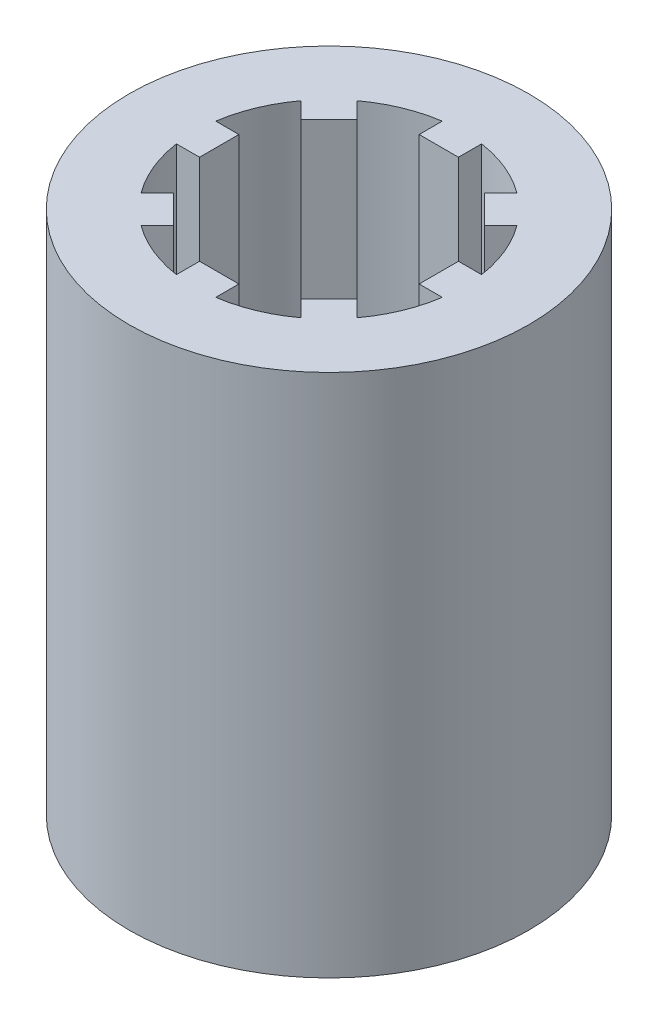
ISO-10303-21;
HEADER;
FILE_DESCRIPTION(('STEP AP214'),'2;1');
FILE_NAME('part.step','',(''),(''),'','','');
FILE_SCHEMA(('AUTOMOTIVE_DESIGN { 1 0 10303 214 1 1 1 1 }'));
ENDSEC;
DATA;
#1=APPLICATION_CONTEXT('core data for automotive mechanical design processes');
#2=APPLICATION_PROTOCOL_DEFINITION('international standard','automotive_design',2000,#1);
#3=PRODUCT_CONTEXT('',#1,'mechanical');
#4=PRODUCT('Part','Part','',(#3));
#5=PRODUCT_RELATED_PRODUCT_CATEGORY('part','',(#4));
#6=PRODUCT_DEFINITION_FORMATION('','',#4);
#7=PRODUCT_DEFINITION_CONTEXT('part definition',#1,'design');
#8=PRODUCT_DEFINITION('design','',#6,#7);
#9=PRODUCT_DEFINITION_SHAPE('','',#8);
#10=(LENGTH_UNIT() NAMED_UNIT(*) SI_UNIT(.MILLI.,.METRE.));
#11=(NAMED_UNIT(*) PLANE_ANGLE_UNIT() SI_UNIT($,.RADIAN.));
#12=(NAMED_UNIT(*) SI_UNIT($,.STERADIAN.) SOLID_ANGLE_UNIT());
#13=UNCERTAINTY_MEASURE_WITH_UNIT(LENGTH_MEASURE(1.E-05),#10,'distance_accuracy_value','');
#14=(GEOMETRIC_REPRESENTATION_CONTEXT(3) GLOBAL_UNCERTAINTY_ASSIGNED_CONTEXT((#13)) GLOBAL_UNIT_ASSIGNED_CONTEXT((#10,
#11,#12)) REPRESENTATION_CONTEXT('',''));
#15=CARTESIAN_POINT('',(0.,0.,0.));
#16=DIRECTION('',(0.,0.,1.));
#17=DIRECTION('',(1.,0.,0.));
#18=AXIS2_PLACEMENT_3D('',#15,#16,#17);
#19=CARTESIAN_POINT('',(0.,50.8,0.));
#20=DIRECTION('',(0.,1.,0.));
#21=DIRECTION('',(0.,0.,1.));
#22=AXIS2_PLACEMENT_3D('',#19,#20,#21);
#23=PLANE('',#22);
#24=CARTESIAN_POINT('',(0.,50.8,0.));
#25=DIRECTION('',(0.,1.,0.));
#26=DIRECTION('',(0.,0.,1.));
#27=AXIS2_PLACEMENT_3D('',#24,#25,#26);
#28=CIRCLE('',#27,19.3675);
#29=CARTESIAN_POINT('',(0.,50.8,19.3675));
#30=VERTEX_POINT('',#29);
#31=EDGE_CURVE('E11',#30,#30,#28,.T.);
#32=ORIENTED_EDGE('',*,*,#31,.T.);
#33=EDGE_LOOP('',(#32));
#34=FACE_BOUND('',#33,.T.);
#35=DIRECTION('',(0.707106781186544,0.,0.707106781186552));
#36=VECTOR('',#35,1.);
#37=CARTESIAN_POINT('',(-7.75862688564912,50.8,-10.4527037219699));
#38=LINE('',#37,#36);
#39=CARTESIAN_POINT('',(-7.75862688564912,50.8,-10.4527037219699));
#40=VERTEX_POINT('',#39);
#41=CARTESIAN_POINT('',(-6.17392608323505,50.8,-8.86800291955578));
#42=VERTEX_POINT('',#41);
#43=EDGE_CURVE('E258',#40,#42,#38,.T.);
#44=ORIENTED_EDGE('',*,*,#43,.F.);
#45=CARTESIAN_POINT('',(0.,50.8,0.));
#46=DIRECTION('',(0.,1.,0.));
#47=DIRECTION('',(0.,0.,1.));
#48=AXIS2_PLACEMENT_3D('',#45,#46,#47);
#49=CIRCLE('',#48,13.0175);
#50=CARTESIAN_POINT('',(-1.905,50.8,-12.8773553670775));
#51=VERTEX_POINT('',#50);
#52=EDGE_CURVE('E249',#51,#40,#49,.T.);
#53=ORIENTED_EDGE('',*,*,#52,.F.);
#54=DIRECTION('',(0.,0.,-1.));
#55=VECTOR('',#54,1.);
#56=CARTESIAN_POINT('',(-1.905,50.8,-12.8773553670775));
#57=LINE('',#56,#55);
#58=CARTESIAN_POINT('',(-1.905,50.8,-10.63625));
#59=VERTEX_POINT('',#58);
#60=EDGE_CURVE('E361',#59,#51,#57,.T.);
#61=ORIENTED_EDGE('',*,*,#60,.F.);
#62=DIRECTION('',(-1.,0.,0.));
#63=VECTOR('',#62,1.);
#64=CARTESIAN_POINT('',(1.90500000000001,50.8,-10.63625));
#65=LINE('',#64,#63);
#66=CARTESIAN_POINT('',(1.90500000000001,50.8,-10.63625));
#67=VERTEX_POINT('',#66);
#68=EDGE_CURVE('E358',#67,#59,#65,.T.);
#69=ORIENTED_EDGE('',*,*,#68,.F.);
#70=DIRECTION('',(0.,0.,1.));
#71=VECTOR('',#70,1.);
#72=CARTESIAN_POINT('',(1.905,50.8,-12.8773553670775));
#73=LINE('',#72,#71);
#74=CARTESIAN_POINT('',(1.905,50.8,-12.8773553670775));
#75=VERTEX_POINT('',#74);
#76=EDGE_CURVE('E355',#75,#67,#73,.T.);
#77=ORIENTED_EDGE('',*,*,#76,.F.);
#78=CARTESIAN_POINT('',(0.,50.8,0.));
#79=DIRECTION('',(0.,1.,0.));
#80=DIRECTION('',(0.,0.,1.));
#81=AXIS2_PLACEMENT_3D('',#78,#79,#80);
#82=CIRCLE('',#81,13.0175);
#83=CARTESIAN_POINT('',(7.75862688564911,50.8,-10.4527037219699));
#84=VERTEX_POINT('',#83);
#85=EDGE_CURVE('E352',#84,#75,#82,.T.);
#86=ORIENTED_EDGE('',*,*,#85,.F.);
#87=DIRECTION('',(0.707106781186548,0.,-0.707106781186547));
#88=VECTOR('',#87,1.);
#89=CARTESIAN_POINT('',(7.75862688564911,50.8,-10.4527037219699));
#90=LINE('',#89,#88);
#91=CARTESIAN_POINT('',(6.17392608323504,50.8,-8.86800291955579));
#92=VERTEX_POINT('',#91);
#93=EDGE_CURVE('E349',#92,#84,#90,.T.);
#94=ORIENTED_EDGE('',*,*,#93,.F.);
#95=DIRECTION('',(-0.707106781186547,0.,-0.707106781186548));
#96=VECTOR('',#95,1.);
#97=CARTESIAN_POINT('',(8.86800291955579,50.8,-6.17392608323503));
#98=LINE('',#97,#96);
#99=CARTESIAN_POINT('',(8.86800291955579,50.8,-6.17392608323503));
#100=VERTEX_POINT('',#99);
#101=EDGE_CURVE('E346',#100,#92,#98,.T.);
#102=ORIENTED_EDGE('',*,*,#101,.F.);
#103=DIRECTION('',(-0.707106781186543,0.,0.707106781186552));
#104=VECTOR('',#103,1.);
#105=CARTESIAN_POINT('',(10.4527037219699,50.8,-7.75862688564912));
#106=LINE('',#105,#104);
#107=CARTESIAN_POINT('',(10.4527037219699,50.8,-7.75862688564912));
#108=VERTEX_POINT('',#107);
#109=EDGE_CURVE('E343',#108,#100,#106,.T.);
#110=ORIENTED_EDGE('',*,*,#109,.F.);
#111=CARTESIAN_POINT('',(0.,50.8,0.));
#112=DIRECTION('',(0.,1.,0.));
#113=DIRECTION('',(0.,0.,1.));
#114=AXIS2_PLACEMENT_3D('',#111,#112,#113);
#115=CIRCLE('',#114,13.0175);
#116=CARTESIAN_POINT('',(12.8773553670775,50.8,-1.905));
#117=VERTEX_POINT('',#116);
#118=EDGE_CURVE('E340',#117,#108,#115,.T.);
#119=ORIENTED_EDGE('',*,*,#118,.F.);
#120=DIRECTION('',(1.,0.,0.));
#121=VECTOR('',#120,1.);
#122=CARTESIAN_POINT('',(12.8773553670775,50.8,-1.905));
#123=LINE('',#122,#121);
#124=CARTESIAN_POINT('',(10.63625,50.8,-1.905));
#125=VERTEX_POINT('',#124);
#126=EDGE_CURVE('E337',#125,#117,#123,.T.);
#127=ORIENTED_EDGE('',*,*,#126,.F.);
#128=DIRECTION('',(0.,0.,-1.));
#129=VECTOR('',#128,1.);
#130=CARTESIAN_POINT('',(10.63625,50.8,1.905));
#131=LINE('',#130,#129);
#132=CARTESIAN_POINT('',(10.63625,50.8,1.905));
#133=VERTEX_POINT('',#132);
#134=EDGE_CURVE('E334',#133,#125,#131,.T.);
#135=ORIENTED_EDGE('',*,*,#134,.F.);
#136=DIRECTION('',(-1.,0.,0.));
#137=VECTOR('',#136,1.);
#138=CARTESIAN_POINT('',(12.8773553670775,50.8,1.905));
#139=LINE('',#138,#137);
#140=CARTESIAN_POINT('',(12.8773553670775,50.8,1.905));
#141=VERTEX_POINT('',#140);
#142=EDGE_CURVE('E331',#141,#133,#139,.T.);
#143=ORIENTED_EDGE('',*,*,#142,.F.);
#144=CARTESIAN_POINT('',(0.,50.8,0.));
#145=DIRECTION('',(0.,1.,0.));
#146=DIRECTION('',(0.,0.,1.));
#147=AXIS2_PLACEMENT_3D('',#144,#145,#146);
#148=CIRCLE('',#147,13.0175);
#149=CARTESIAN_POINT('',(10.4527037219699,50.8,7.75862688564911));
#150=VERTEX_POINT('',#149);
#151=EDGE_CURVE('E328',#150,#141,#148,.T.);
#152=ORIENTED_EDGE('',*,*,#151,.F.);
#153=DIRECTION('',(0.707106781186548,0.,0.707106781186547));
#154=VECTOR('',#153,1.);
#155=CARTESIAN_POINT('',(10.4527037219699,50.8,7.75862688564911));
#156=LINE('',#155,#154);
#157=CARTESIAN_POINT('',(8.86800291955579,50.8,6.17392608323503));
#158=VERTEX_POINT('',#157);
#159=EDGE_CURVE('E325',#158,#150,#156,.T.);
#160=ORIENTED_EDGE('',*,*,#159,.F.);
#161=DIRECTION('',(0.707106781186547,0.,-0.707106781186548));
#162=VECTOR('',#161,1.);
#163=CARTESIAN_POINT('',(6.17392608323504,50.8,8.86800291955579));
#164=LINE('',#163,#162);
#165=CARTESIAN_POINT('',(6.17392608323504,50.8,8.86800291955579));
#166=VERTEX_POINT('',#165);
#167=EDGE_CURVE('E322',#166,#158,#164,.T.);
#168=ORIENTED_EDGE('',*,*,#167,.F.);
#169=DIRECTION('',(-0.707106781186552,0.,-0.707106781186543));
#170=VECTOR('',#169,1.);
#171=CARTESIAN_POINT('',(7.75862688564913,50.8,10.4527037219699));
#172=LINE('',#171,#170);
#173=CARTESIAN_POINT('',(7.75862688564913,50.8,10.4527037219699));
#174=VERTEX_POINT('',#173);
#175=EDGE_CURVE('E319',#174,#166,#172,.T.);
#176=ORIENTED_EDGE('',*,*,#175,.F.);
#177=CARTESIAN_POINT('',(0.,50.8,0.));
#178=DIRECTION('',(0.,1.,0.));
#179=DIRECTION('',(0.,0.,1.));
#180=AXIS2_PLACEMENT_3D('',#177,#178,#179);
#181=CIRCLE('',#180,13.0175);
#182=CARTESIAN_POINT('',(1.905,50.8,12.8773553670775));
#183=VERTEX_POINT('',#182);
#184=EDGE_CURVE('E316',#183,#174,#181,.T.);
#185=ORIENTED_EDGE('',*,*,#184,.F.);
#186=DIRECTION('',(0.,0.,1.));
#187=VECTOR('',#186,1.);
#188=CARTESIAN_POINT('',(1.905,50.8,12.8773553670775));
#189=LINE('',#188,#187);
#190=CARTESIAN_POINT('',(1.905,50.8,10.63625));
#191=VERTEX_POINT('',#190);
#192=EDGE_CURVE('E313',#191,#183,#189,.T.);
#193=ORIENTED_EDGE('',*,*,#192,.F.);
#194=DIRECTION('',(1.,0.,0.));
#195=VECTOR('',#194,1.);
#196=CARTESIAN_POINT('',(-1.905,50.8,10.63625));
#197=LINE('',#196,#195);
#198=CARTESIAN_POINT('',(-1.905,50.8,10.63625));
#199=VERTEX_POINT('',#198);
#200=EDGE_CURVE('E310',#199,#191,#197,.T.);
#201=ORIENTED_EDGE('',*,*,#200,.F.);
#202=DIRECTION('',(0.,0.,-1.));
#203=VECTOR('',#202,1.);
#204=CARTESIAN_POINT('',(-1.905,50.8,12.8773553670775));
#205=LINE('',#204,#203);
#206=CARTESIAN_POINT('',(-1.90500000000001,50.8,12.8773553670775));
#207=VERTEX_POINT('',#206);
#208=EDGE_CURVE('E307',#207,#199,#205,.T.);
#209=ORIENTED_EDGE('',*,*,#208,.F.);
#210=CARTESIAN_POINT('',(0.,50.8,0.));
#211=DIRECTION('',(0.,1.,0.));
#212=DIRECTION('',(0.,0.,1.));
#213=AXIS2_PLACEMENT_3D('',#210,#211,#212);
#214=CIRCLE('',#213,13.0175);
#215=CARTESIAN_POINT('',(-7.75862688564911,50.8,10.4527037219699));
#216=VERTEX_POINT('',#215);
#217=EDGE_CURVE('E304',#216,#207,#214,.T.);
#218=ORIENTED_EDGE('',*,*,#217,.F.);
#219=DIRECTION('',(-0.707106781186547,0.,0.707106781186548));
#220=VECTOR('',#219,1.);
#221=CARTESIAN_POINT('',(-7.75862688564911,50.8,10.4527037219699));
#222=LINE('',#221,#220);
#223=CARTESIAN_POINT('',(-6.17392608323503,50.8,8.86800291955579));
#224=VERTEX_POINT('',#223);
#225=EDGE_CURVE('E301',#224,#216,#222,.T.);
#226=ORIENTED_EDGE('',*,*,#225,.F.);
#227=DIRECTION('',(0.707106781186548,0.,0.707106781186547));
#228=VECTOR('',#227,1.);
#229=CARTESIAN_POINT('',(-8.86800291955579,50.8,6.17392608323504));
#230=LINE('',#229,#228);
#231=CARTESIAN_POINT('',(-8.86800291955579,50.8,6.17392608323504));
#232=VERTEX_POINT('',#231);
#233=EDGE_CURVE('E298',#232,#224,#230,.T.);
#234=ORIENTED_EDGE('',*,*,#233,.F.);
#235=DIRECTION('',(0.707106781186544,0.,-0.707106781186551));
#236=VECTOR('',#235,1.);
#237=CARTESIAN_POINT('',(-10.4527037219699,50.8,7.75862688564913));
#238=LINE('',#237,#236);
#239=CARTESIAN_POINT('',(-10.4527037219699,50.8,7.75862688564912));
#240=VERTEX_POINT('',#239);
#241=EDGE_CURVE('E295',#240,#232,#238,.T.);
#242=ORIENTED_EDGE('',*,*,#241,.F.);
#243=CARTESIAN_POINT('',(0.,50.8,0.));
#244=DIRECTION('',(0.,1.,0.));
#245=DIRECTION('',(0.,0.,1.));
#246=AXIS2_PLACEMENT_3D('',#243,#244,#245);
#247=CIRCLE('',#246,13.0175);
#248=CARTESIAN_POINT('',(-12.8773553670775,50.8,1.90500000000003));
#249=VERTEX_POINT('',#248);
#250=EDGE_CURVE('E292',#249,#240,#247,.T.);
#251=ORIENTED_EDGE('',*,*,#250,.F.);
#252=DIRECTION('',(-1.,0.,0.));
#253=VECTOR('',#252,1.);
#254=CARTESIAN_POINT('',(-12.8773553670775,50.8,1.90500000000003));
#255=LINE('',#254,#253);
#256=CARTESIAN_POINT('',(-10.63625,50.8,1.90500000000002));
#257=VERTEX_POINT('',#256);
#258=EDGE_CURVE('E289',#257,#249,#255,.T.);
#259=ORIENTED_EDGE('',*,*,#258,.F.);
#260=DIRECTION('',(0.,0.,1.));
#261=VECTOR('',#260,1.);
#262=CARTESIAN_POINT('',(-10.63625,50.8,-1.90499999999999));
#263=LINE('',#262,#261);
#264=CARTESIAN_POINT('',(-10.63625,50.8,-1.90499999999999));
#265=VERTEX_POINT('',#264);
#266=EDGE_CURVE('E286',#265,#257,#263,.T.);
#267=ORIENTED_EDGE('',*,*,#266,.F.);
#268=DIRECTION('',(1.,0.,0.));
#269=VECTOR('',#268,1.);
#270=CARTESIAN_POINT('',(-12.8773553670775,50.8,-1.90499999999997));
#271=LINE('',#270,#269);
#272=CARTESIAN_POINT('',(-12.8773553670775,50.8,-1.90499999999997));
#273=VERTEX_POINT('',#272);
#274=EDGE_CURVE('E283',#273,#265,#271,.T.);
#275=ORIENTED_EDGE('',*,*,#274,.F.);
#276=CARTESIAN_POINT('',(0.,50.8,0.));
#277=DIRECTION('',(0.,1.,0.));
#278=DIRECTION('',(0.,0.,1.));
#279=AXIS2_PLACEMENT_3D('',#276,#277,#278);
#280=CIRCLE('',#279,13.0175);
#281=CARTESIAN_POINT('',(-10.4527037219699,50.8,-7.75862688564912));
#282=VERTEX_POINT('',#281);
#283=EDGE_CURVE('E280',#282,#273,#280,.T.);
#284=ORIENTED_EDGE('',*,*,#283,.F.);
#285=DIRECTION('',(-0.707106781186539,0.,-0.707106781186556));
#286=VECTOR('',#285,1.);
#287=CARTESIAN_POINT('',(-10.4527037219699,50.8,-7.75862688564912));
#288=LINE('',#287,#286);
#289=CARTESIAN_POINT('',(-8.8680029195558,50.8,-6.17392608323502));
#290=VERTEX_POINT('',#289);
#291=EDGE_CURVE('E275',#290,#282,#288,.T.);
#292=ORIENTED_EDGE('',*,*,#291,.F.);
#293=DIRECTION('',(-0.707106781186546,0.,0.707106781186549));
#294=VECTOR('',#293,1.);
#295=CARTESIAN_POINT('',(-6.17392608323505,50.8,-8.86800291955578));
#296=LINE('',#295,#294);
#297=EDGE_CURVE('E271',#42,#290,#296,.T.);
#298=ORIENTED_EDGE('',*,*,#297,.F.);
#299=EDGE_LOOP('',(#44,#53,#61,#69,#77,#86,#94,#102,#110,#119,#127,#135,#143,#152,#160,#168,
#176,#185,#193,#201,#209,#218,#226,#234,#242,#251,#259,#267,#275,#284,#292,#298));
#300=FACE_BOUND('',#299,.T.);
#301=ADVANCED_FACE('F39',(#34,#300),#23,.T.);
#302=CARTESIAN_POINT('',(0.,0.,0.));
#303=DIRECTION('',(0.,1.,0.));
#304=DIRECTION('',(0.,0.,1.));
#305=AXIS2_PLACEMENT_3D('',#302,#303,#304);
#306=PLANE('',#305);
#307=CARTESIAN_POINT('',(0.,0.,0.));
#308=DIRECTION('',(0.,1.,0.));
#309=DIRECTION('',(0.,0.,1.));
#310=AXIS2_PLACEMENT_3D('',#307,#308,#309);
#311=CIRCLE('',#310,19.3675);
#312=CARTESIAN_POINT('',(0.,0.,19.3675));
#313=VERTEX_POINT('',#312);
#314=EDGE_CURVE('E43',#313,#313,#311,.T.);
#315=ORIENTED_EDGE('',*,*,#314,.F.);
#316=EDGE_LOOP('',(#315));
#317=FACE_BOUND('',#316,.T.);
#318=CARTESIAN_POINT('',(0.,0.,0.));
#319=DIRECTION('',(0.,1.,0.));
#320=DIRECTION('',(0.,0.,1.));
#321=AXIS2_PLACEMENT_3D('',#318,#319,#320);
#322=CIRCLE('',#321,13.0175);
#323=CARTESIAN_POINT('',(-1.905,0.,-12.8773553670775));
#324=VERTEX_POINT('',#323);
#325=CARTESIAN_POINT('',(-7.75862688564912,0.,-10.4527037219699));
#326=VERTEX_POINT('',#325);
#327=EDGE_CURVE('E63',#324,#326,#322,.T.);
#328=ORIENTED_EDGE('',*,*,#327,.T.);
#329=DIRECTION('',(0.707106781186544,0.,0.707106781186552));
#330=VECTOR('',#329,1.);
#331=CARTESIAN_POINT('',(-7.75862688564912,0.,-10.4527037219699));
#332=LINE('',#331,#330);
#333=CARTESIAN_POINT('',(-6.17392608323505,0.,-8.86800291955578));
#334=VERTEX_POINT('',#333);
#335=EDGE_CURVE('E265',#326,#334,#332,.T.);
#336=ORIENTED_EDGE('',*,*,#335,.T.);
#337=DIRECTION('',(-0.707106781186546,0.,0.707106781186549));
#338=VECTOR('',#337,1.);
#339=CARTESIAN_POINT('',(-6.17392608323505,0.,-8.86800291955578));
#340=LINE('',#339,#338);
#341=CARTESIAN_POINT('',(-8.8680029195558,0.,-6.17392608323502));
#342=VERTEX_POINT('',#341);
#343=EDGE_CURVE('E368',#334,#342,#340,.T.);
#344=ORIENTED_EDGE('',*,*,#343,.T.);
#345=DIRECTION('',(-0.707106781186539,0.,-0.707106781186556));
#346=VECTOR('',#345,1.);
#347=CARTESIAN_POINT('',(-10.4527037219699,0.,-7.75862688564912));
#348=LINE('',#347,#346);
#349=CARTESIAN_POINT('',(-10.4527037219699,0.,-7.75862688564912));
#350=VERTEX_POINT('',#349);
#351=EDGE_CURVE('E372',#342,#350,#348,.T.);
#352=ORIENTED_EDGE('',*,*,#351,.T.);
#353=CARTESIAN_POINT('',(0.,0.,0.));
#354=DIRECTION('',(0.,1.,0.));
#355=DIRECTION('',(0.,0.,1.));
#356=AXIS2_PLACEMENT_3D('',#353,#354,#355);
#357=CIRCLE('',#356,13.0175);
#358=CARTESIAN_POINT('',(-12.8773553670775,0.,-1.90499999999997));
#359=VERTEX_POINT('',#358);
#360=EDGE_CURVE('E376',#350,#359,#357,.T.);
#361=ORIENTED_EDGE('',*,*,#360,.T.);
#362=DIRECTION('',(1.,0.,0.));
#363=VECTOR('',#362,1.);
#364=CARTESIAN_POINT('',(-12.8773553670775,0.,-1.90499999999997));
#365=LINE('',#364,#363);
#366=CARTESIAN_POINT('',(-10.63625,0.,-1.90499999999999));
#367=VERTEX_POINT('',#366);
#368=EDGE_CURVE('E380',#359,#367,#365,.T.);
#369=ORIENTED_EDGE('',*,*,#368,.T.);
#370=DIRECTION('',(0.,0.,1.));
#371=VECTOR('',#370,1.);
#372=CARTESIAN_POINT('',(-10.63625,0.,-1.90499999999999));
#373=LINE('',#372,#371);
#374=CARTESIAN_POINT('',(-10.63625,0.,1.90500000000002));
#375=VERTEX_POINT('',#374);
#376=EDGE_CURVE('E384',#367,#375,#373,.T.);
#377=ORIENTED_EDGE('',*,*,#376,.T.);
#378=DIRECTION('',(-1.,0.,0.));
#379=VECTOR('',#378,1.);
#380=CARTESIAN_POINT('',(-12.8773553670775,0.,1.90500000000003));
#381=LINE('',#380,#379);
#382=CARTESIAN_POINT('',(-12.8773553670775,0.,1.90500000000003));
#383=VERTEX_POINT('',#382);
#384=EDGE_CURVE('E388',#375,#383,#381,.T.);
#385=ORIENTED_EDGE('',*,*,#384,.T.);
#386=CARTESIAN_POINT('',(0.,0.,0.));
#387=DIRECTION('',(0.,1.,0.));
#388=DIRECTION('',(0.,0.,1.));
#389=AXIS2_PLACEMENT_3D('',#386,#387,#388);
#390=CIRCLE('',#389,13.0175);
#391=CARTESIAN_POINT('',(-10.4527037219699,0.,7.75862688564912));
#392=VERTEX_POINT('',#391);
#393=EDGE_CURVE('E392',#383,#392,#390,.T.);
#394=ORIENTED_EDGE('',*,*,#393,.T.);
#395=DIRECTION('',(0.707106781186544,0.,-0.707106781186551));
#396=VECTOR('',#395,1.);
#397=CARTESIAN_POINT('',(-10.4527037219699,0.,7.75862688564913));
#398=LINE('',#397,#396);
#399=CARTESIAN_POINT('',(-8.86800291955579,0.,6.17392608323504));
#400=VERTEX_POINT('',#399);
#401=EDGE_CURVE('E396',#392,#400,#398,.T.);
#402=ORIENTED_EDGE('',*,*,#401,.T.);
#403=DIRECTION('',(0.707106781186548,0.,0.707106781186547));
#404=VECTOR('',#403,1.);
#405=CARTESIAN_POINT('',(-8.86800291955579,0.,6.17392608323504));
#406=LINE('',#405,#404);
#407=CARTESIAN_POINT('',(-6.17392608323503,0.,8.86800291955579));
#408=VERTEX_POINT('',#407);
#409=EDGE_CURVE('E400',#400,#408,#406,.T.);
#410=ORIENTED_EDGE('',*,*,#409,.T.);
#411=DIRECTION('',(-0.707106781186547,0.,0.707106781186548));
#412=VECTOR('',#411,1.);
#413=CARTESIAN_POINT('',(-7.75862688564911,0.,10.4527037219699));
#414=LINE('',#413,#412);
#415=CARTESIAN_POINT('',(-7.75862688564911,0.,10.4527037219699));
#416=VERTEX_POINT('',#415);
#417=EDGE_CURVE('E404',#408,#416,#414,.T.);
#418=ORIENTED_EDGE('',*,*,#417,.T.);
#419=CARTESIAN_POINT('',(0.,0.,0.));
#420=DIRECTION('',(0.,1.,0.));
#421=DIRECTION('',(0.,0.,1.));
#422=AXIS2_PLACEMENT_3D('',#419,#420,#421);
#423=CIRCLE('',#422,13.0175);
#424=CARTESIAN_POINT('',(-1.90500000000001,0.,12.8773553670775));
#425=VERTEX_POINT('',#424);
#426=EDGE_CURVE('E408',#416,#425,#423,.T.);
#427=ORIENTED_EDGE('',*,*,#426,.T.);
#428=DIRECTION('',(0.,0.,-1.));
#429=VECTOR('',#428,1.);
#430=CARTESIAN_POINT('',(-1.905,0.,12.8773553670775));
#431=LINE('',#430,#429);
#432=CARTESIAN_POINT('',(-1.905,0.,10.63625));
#433=VERTEX_POINT('',#432);
#434=EDGE_CURVE('E412',#425,#433,#431,.T.);
#435=ORIENTED_EDGE('',*,*,#434,.T.);
#436=DIRECTION('',(1.,0.,0.));
#437=VECTOR('',#436,1.);
#438=CARTESIAN_POINT('',(-1.905,0.,10.63625));
#439=LINE('',#438,#437);
#440=CARTESIAN_POINT('',(1.905,0.,10.63625));
#441=VERTEX_POINT('',#440);
#442=EDGE_CURVE('E416',#433,#441,#439,.T.);
#443=ORIENTED_EDGE('',*,*,#442,.T.);
#444=DIRECTION('',(0.,0.,1.));
#445=VECTOR('',#444,1.);
#446=CARTESIAN_POINT('',(1.905,0.,12.8773553670775));
#447=LINE('',#446,#445);
#448=CARTESIAN_POINT('',(1.905,0.,12.8773553670775));
#449=VERTEX_POINT('',#448);
#450=EDGE_CURVE('E420',#441,#449,#447,.T.);
#451=ORIENTED_EDGE('',*,*,#450,.T.);
#452=CARTESIAN_POINT('',(0.,0.,0.));
#453=DIRECTION('',(0.,1.,0.));
#454=DIRECTION('',(0.,0.,1.));
#455=AXIS2_PLACEMENT_3D('',#452,#453,#454);
#456=CIRCLE('',#455,13.0175);
#457=CARTESIAN_POINT('',(7.75862688564913,0.,10.4527037219699));
#458=VERTEX_POINT('',#457);
#459=EDGE_CURVE('E424',#449,#458,#456,.T.);
#460=ORIENTED_EDGE('',*,*,#459,.T.);
#461=DIRECTION('',(-0.707106781186552,0.,-0.707106781186543));
#462=VECTOR('',#461,1.);
#463=CARTESIAN_POINT('',(7.75862688564913,0.,10.4527037219699));
#464=LINE('',#463,#462);
#465=CARTESIAN_POINT('',(6.17392608323504,0.,8.86800291955579));
#466=VERTEX_POINT('',#465);
#467=EDGE_CURVE('E428',#458,#466,#464,.T.);
#468=ORIENTED_EDGE('',*,*,#467,.T.);
#469=DIRECTION('',(0.707106781186547,0.,-0.707106781186548));
#470=VECTOR('',#469,1.);
#471=CARTESIAN_POINT('',(6.17392608323504,0.,8.86800291955579));
#472=LINE('',#471,#470);
#473=CARTESIAN_POINT('',(8.86800291955579,0.,6.17392608323503));
#474=VERTEX_POINT('',#473);
#475=EDGE_CURVE('E432',#466,#474,#472,.T.);
#476=ORIENTED_EDGE('',*,*,#475,.T.);
#477=DIRECTION('',(0.707106781186548,0.,0.707106781186547));
#478=VECTOR('',#477,1.);
#479=CARTESIAN_POINT('',(10.4527037219699,0.,7.75862688564911));
#480=LINE('',#479,#478);
#481=CARTESIAN_POINT('',(10.4527037219699,0.,7.75862688564911));
#482=VERTEX_POINT('',#481);
#483=EDGE_CURVE('E436',#474,#482,#480,.T.);
#484=ORIENTED_EDGE('',*,*,#483,.T.);
#485=CARTESIAN_POINT('',(0.,0.,0.));
#486=DIRECTION('',(0.,1.,0.));
#487=DIRECTION('',(0.,0.,1.));
#488=AXIS2_PLACEMENT_3D('',#485,#486,#487);
#489=CIRCLE('',#488,13.0175);
#490=CARTESIAN_POINT('',(12.8773553670775,0.,1.905));
#491=VERTEX_POINT('',#490);
#492=EDGE_CURVE('E440',#482,#491,#489,.T.);
#493=ORIENTED_EDGE('',*,*,#492,.T.);
#494=DIRECTION('',(-1.,0.,0.));
#495=VECTOR('',#494,1.);
#496=CARTESIAN_POINT('',(12.8773553670775,0.,1.905));
#497=LINE('',#496,#495);
#498=CARTESIAN_POINT('',(10.63625,0.,1.905));
#499=VERTEX_POINT('',#498);
#500=EDGE_CURVE('E444',#491,#499,#497,.T.);
#501=ORIENTED_EDGE('',*,*,#500,.T.);
#502=DIRECTION('',(0.,0.,-1.));
#503=VECTOR('',#502,1.);
#504=CARTESIAN_POINT('',(10.63625,0.,1.905));
#505=LINE('',#504,#503);
#506=CARTESIAN_POINT('',(10.63625,0.,-1.905));
#507=VERTEX_POINT('',#506);
#508=EDGE_CURVE('E448',#499,#507,#505,.T.);
#509=ORIENTED_EDGE('',*,*,#508,.T.);
#510=DIRECTION('',(1.,0.,0.));
#511=VECTOR('',#510,1.);
#512=CARTESIAN_POINT('',(12.8773553670775,0.,-1.905));
#513=LINE('',#512,#511);
#514=CARTESIAN_POINT('',(12.8773553670775,0.,-1.905));
#515=VERTEX_POINT('',#514);
#516=EDGE_CURVE('E452',#507,#515,#513,.T.);
#517=ORIENTED_EDGE('',*,*,#516,.T.);
#518=CARTESIAN_POINT('',(0.,0.,0.));
#519=DIRECTION('',(0.,1.,0.));
#520=DIRECTION('',(0.,0.,1.));
#521=AXIS2_PLACEMENT_3D('',#518,#519,#520);
#522=CIRCLE('',#521,13.0175);
#523=CARTESIAN_POINT('',(10.4527037219699,0.,-7.75862688564912));
#524=VERTEX_POINT('',#523);
#525=EDGE_CURVE('E456',#515,#524,#522,.T.);
#526=ORIENTED_EDGE('',*,*,#525,.T.);
#527=DIRECTION('',(-0.707106781186543,0.,0.707106781186552));
#528=VECTOR('',#527,1.);
#529=CARTESIAN_POINT('',(10.4527037219699,0.,-7.75862688564912));
#530=LINE('',#529,#528);
#531=CARTESIAN_POINT('',(8.86800291955579,0.,-6.17392608323503));
#532=VERTEX_POINT('',#531);
#533=EDGE_CURVE('E460',#524,#532,#530,.T.);
#534=ORIENTED_EDGE('',*,*,#533,.T.);
#535=DIRECTION('',(-0.707106781186547,0.,-0.707106781186548));
#536=VECTOR('',#535,1.);
#537=CARTESIAN_POINT('',(8.86800291955579,0.,-6.17392608323503));
#538=LINE('',#537,#536);
#539=CARTESIAN_POINT('',(6.17392608323504,0.,-8.86800291955579));
#540=VERTEX_POINT('',#539);
#541=EDGE_CURVE('E464',#532,#540,#538,.T.);
#542=ORIENTED_EDGE('',*,*,#541,.T.);
#543=DIRECTION('',(0.707106781186548,0.,-0.707106781186547));
#544=VECTOR('',#543,1.);
#545=CARTESIAN_POINT('',(7.75862688564911,0.,-10.4527037219699));
#546=LINE('',#545,#544);
#547=CARTESIAN_POINT('',(7.75862688564911,0.,-10.4527037219699));
#548=VERTEX_POINT('',#547);
#549=EDGE_CURVE('E468',#540,#548,#546,.T.);
#550=ORIENTED_EDGE('',*,*,#549,.T.);
#551=CARTESIAN_POINT('',(0.,0.,0.));
#552=DIRECTION('',(0.,1.,0.));
#553=DIRECTION('',(0.,0.,1.));
#554=AXIS2_PLACEMENT_3D('',#551,#552,#553);
#555=CIRCLE('',#554,13.0175);
#556=CARTESIAN_POINT('',(1.905,0.,-12.8773553670775));
#557=VERTEX_POINT('',#556);
#558=EDGE_CURVE('E472',#548,#557,#555,.T.);
#559=ORIENTED_EDGE('',*,*,#558,.T.);
#560=DIRECTION('',(0.,0.,1.));
#561=VECTOR('',#560,1.);
#562=CARTESIAN_POINT('',(1.905,0.,-12.8773553670775));
#563=LINE('',#562,#561);
#564=CARTESIAN_POINT('',(1.90500000000001,0.,-10.63625));
#565=VERTEX_POINT('',#564);
#566=EDGE_CURVE('E476',#557,#565,#563,.T.);
#567=ORIENTED_EDGE('',*,*,#566,.T.);
#568=DIRECTION('',(-1.,0.,0.));
#569=VECTOR('',#568,1.);
#570=CARTESIAN_POINT('',(1.90500000000001,0.,-10.63625));
#571=LINE('',#570,#569);
#572=CARTESIAN_POINT('',(-1.905,0.,-10.63625));
#573=VERTEX_POINT('',#572);
#574=EDGE_CURVE('E480',#565,#573,#571,.T.);
#575=ORIENTED_EDGE('',*,*,#574,.T.);
#576=DIRECTION('',(0.,0.,-1.));
#577=VECTOR('',#576,1.);
#578=CARTESIAN_POINT('',(-1.905,0.,-12.8773553670775));
#579=LINE('',#578,#577);
#580=EDGE_CURVE('E259',#573,#324,#579,.T.);
#581=ORIENTED_EDGE('',*,*,#580,.T.);
#582=EDGE_LOOP('',(#328,#336,#344,#352,#361,#369,#377,#385,#394,#402,#410,#418,#427,#435,#443,
#451,#460,#468,#476,#484,#493,#501,#509,#517,#526,#534,#542,#550,#559,#567,#575,#581));
#583=FACE_BOUND('',#582,.T.);
#584=ADVANCED_FACE('F582',(#317,#583),#306,.F.);
#585=CARTESIAN_POINT('',(0.,50.8,0.));
#586=DIRECTION('',(0.,-1.,0.));
#587=DIRECTION('',(0.,0.,-1.));
#588=AXIS2_PLACEMENT_3D('',#585,#586,#587);
#589=CYLINDRICAL_SURFACE('',#588,19.3675);
#590=ORIENTED_EDGE('',*,*,#31,.F.);
#591=EDGE_LOOP('',(#590));
#592=FACE_BOUND('',#591,.T.);
#593=ORIENTED_EDGE('',*,*,#314,.T.);
#594=EDGE_LOOP('',(#593));
#595=FACE_BOUND('',#594,.T.);
#596=ADVANCED_FACE('F41',(#592,#595),#589,.T.);
#597=CARTESIAN_POINT('',(0.,50.8,0.));
#598=DIRECTION('',(0.,-1.,0.));
#599=DIRECTION('',(0.,0.,-1.));
#600=AXIS2_PLACEMENT_3D('',#597,#598,#599);
#601=CYLINDRICAL_SURFACE('',#600,13.0175);
#602=ORIENTED_EDGE('',*,*,#327,.F.);
#603=DIRECTION('',(0.,-1.,0.));
#604=VECTOR('',#603,1.);
#605=CARTESIAN_POINT('',(-1.905,50.8,-12.8773553670775));
#606=LINE('',#605,#604);
#607=EDGE_CURVE('E253',#51,#324,#606,.T.);
#608=ORIENTED_EDGE('',*,*,#607,.F.);
#609=ORIENTED_EDGE('',*,*,#52,.T.);
#610=DIRECTION('',(0.,-1.,0.));
#611=VECTOR('',#610,1.);
#612=CARTESIAN_POINT('',(-7.75862688564912,50.8,-10.4527037219699));
#613=LINE('',#612,#611);
#614=EDGE_CURVE('E252',#40,#326,#613,.T.);
#615=ORIENTED_EDGE('',*,*,#614,.T.);
#616=EDGE_LOOP('',(#602,#608,#609,#615));
#617=FACE_BOUND('',#616,.T.);
#618=ADVANCED_FACE('F251',(#617),#601,.F.);
#619=CARTESIAN_POINT('',(-7.75862688564912,50.8,-10.4527037219699));
#620=DIRECTION('',(0.707106781186552,0.,-0.707106781186543));
#621=DIRECTION('',(-0.707106781186543,0.,-0.707106781186552));
#622=AXIS2_PLACEMENT_3D('',#619,#620,#621);
#623=PLANE('',#622);
#624=ORIENTED_EDGE('',*,*,#335,.F.);
#625=ORIENTED_EDGE('',*,*,#614,.F.);
#626=ORIENTED_EDGE('',*,*,#43,.T.);
#627=DIRECTION('',(0.,-1.,0.));
#628=VECTOR('',#627,1.);
#629=CARTESIAN_POINT('',(-6.17392608323505,50.8,-8.86800291955578));
#630=LINE('',#629,#628);
#631=EDGE_CURVE('E267',#42,#334,#630,.T.);
#632=ORIENTED_EDGE('',*,*,#631,.T.);
#633=EDGE_LOOP('',(#624,#625,#626,#632));
#634=FACE_BOUND('',#633,.T.);
#635=ADVANCED_FACE('F262',(#634),#623,.T.);
#636=CARTESIAN_POINT('',(-6.17392608323505,50.8,-8.86800291955578));
#637=DIRECTION('',(0.707106781186549,0.,0.707106781186546));
#638=DIRECTION('',(0.707106781186546,0.,-0.707106781186549));
#639=AXIS2_PLACEMENT_3D('',#636,#637,#638);
#640=PLANE('',#639);
#641=ORIENTED_EDGE('',*,*,#343,.F.);
#642=ORIENTED_EDGE('',*,*,#631,.F.);
#643=ORIENTED_EDGE('',*,*,#297,.T.);
#644=DIRECTION('',(0.,-1.,0.));
#645=VECTOR('',#644,1.);
#646=CARTESIAN_POINT('',(-8.8680029195558,50.8,-6.17392608323502));
#647=LINE('',#646,#645);
#648=EDGE_CURVE('E572',#290,#342,#647,.T.);
#649=ORIENTED_EDGE('',*,*,#648,.T.);
#650=EDGE_LOOP('',(#641,#642,#643,#649));
#651=FACE_BOUND('',#650,.T.);
#652=ADVANCED_FACE('F578',(#651),#640,.T.);
#653=CARTESIAN_POINT('',(-10.4527037219699,50.8,-7.75862688564912));
#654=DIRECTION('',(-0.707106781186556,0.,0.707106781186539));
#655=DIRECTION('',(0.707106781186539,0.,0.707106781186556));
#656=AXIS2_PLACEMENT_3D('',#653,#654,#655);
#657=PLANE('',#656);
#658=ORIENTED_EDGE('',*,*,#351,.F.);
#659=ORIENTED_EDGE('',*,*,#648,.F.);
#660=ORIENTED_EDGE('',*,*,#291,.T.);
#661=DIRECTION('',(0.,-1.,0.));
#662=VECTOR('',#661,1.);
#663=CARTESIAN_POINT('',(-10.4527037219699,50.8,-7.75862688564912));
#664=LINE('',#663,#662);
#665=EDGE_CURVE('E569',#282,#350,#664,.T.);
#666=ORIENTED_EDGE('',*,*,#665,.T.);
#667=EDGE_LOOP('',(#658,#659,#660,#666));
#668=FACE_BOUND('',#667,.T.);
#669=ADVANCED_FACE('F720',(#668),#657,.T.);
#670=CARTESIAN_POINT('',(0.,50.8,0.));
#671=DIRECTION('',(0.,-1.,0.));
#672=DIRECTION('',(0.,0.,-1.));
#673=AXIS2_PLACEMENT_3D('',#670,#671,#672);
#674=CYLINDRICAL_SURFACE('',#673,13.0175);
#675=ORIENTED_EDGE('',*,*,#360,.F.);
#676=ORIENTED_EDGE('',*,*,#665,.F.);
#677=ORIENTED_EDGE('',*,*,#283,.T.);
#678=DIRECTION('',(0.,-1.,0.));
#679=VECTOR('',#678,1.);
#680=CARTESIAN_POINT('',(-12.8773553670775,50.8,-1.90499999999997));
#681=LINE('',#680,#679);
#682=EDGE_CURVE('E566',#273,#359,#681,.T.);
#683=ORIENTED_EDGE('',*,*,#682,.T.);
#684=EDGE_LOOP('',(#675,#676,#677,#683));
#685=FACE_BOUND('',#684,.T.);
#686=ADVANCED_FACE('F717',(#685),#674,.F.);
#687=CARTESIAN_POINT('',(-12.8773553670775,50.8,-1.90499999999997));
#688=DIRECTION('',(0.,0.,-1.));
#689=DIRECTION('',(-1.,0.,0.));
#690=AXIS2_PLACEMENT_3D('',#687,#688,#689);
#691=PLANE('',#690);
#692=ORIENTED_EDGE('',*,*,#368,.F.);
#693=ORIENTED_EDGE('',*,*,#682,.F.);
#694=ORIENTED_EDGE('',*,*,#274,.T.);
#695=DIRECTION('',(0.,-1.,0.));
#696=VECTOR('',#695,1.);
#697=CARTESIAN_POINT('',(-10.63625,50.8,-1.90499999999999));
#698=LINE('',#697,#696);
#699=EDGE_CURVE('E563',#265,#367,#698,.T.);
#700=ORIENTED_EDGE('',*,*,#699,.T.);
#701=EDGE_LOOP('',(#692,#693,#694,#700));
#702=FACE_BOUND('',#701,.T.);
#703=ADVANCED_FACE('F713',(#702),#691,.T.);
#704=CARTESIAN_POINT('',(-10.63625,50.8,-1.90499999999999));
#705=DIRECTION('',(1.,0.,0.));
#706=DIRECTION('',(0.,0.,-1.));
#707=AXIS2_PLACEMENT_3D('',#704,#705,#706);
#708=PLANE('',#707);
#709=ORIENTED_EDGE('',*,*,#376,.F.);
#710=ORIENTED_EDGE('',*,*,#699,.F.);
#711=ORIENTED_EDGE('',*,*,#266,.T.);
#712=DIRECTION('',(0.,-1.,0.));
#713=VECTOR('',#712,1.);
#714=CARTESIAN_POINT('',(-10.63625,50.8,1.90500000000002));
#715=LINE('',#714,#713);
#716=EDGE_CURVE('E560',#257,#375,#715,.T.);
#717=ORIENTED_EDGE('',*,*,#716,.T.);
#718=EDGE_LOOP('',(#709,#710,#711,#717));
#719=FACE_BOUND('',#718,.T.);
#720=ADVANCED_FACE('F710',(#719),#708,.T.);
#721=CARTESIAN_POINT('',(-12.8773553670775,50.8,1.90500000000003));
#722=DIRECTION('',(0.,0.,1.));
#723=DIRECTION('',(1.,0.,0.));
#724=AXIS2_PLACEMENT_3D('',#721,#722,#723);
#725=PLANE('',#724);
#726=ORIENTED_EDGE('',*,*,#384,.F.);
#727=ORIENTED_EDGE('',*,*,#716,.F.);
#728=ORIENTED_EDGE('',*,*,#258,.T.);
#729=DIRECTION('',(0.,-1.,0.));
#730=VECTOR('',#729,1.);
#731=CARTESIAN_POINT('',(-12.8773553670775,50.8,1.90500000000003));
#732=LINE('',#731,#730);
#733=EDGE_CURVE('E557',#249,#383,#732,.T.);
#734=ORIENTED_EDGE('',*,*,#733,.T.);
#735=EDGE_LOOP('',(#726,#727,#728,#734));
#736=FACE_BOUND('',#735,.T.);
#737=ADVANCED_FACE('F702',(#736),#725,.T.);
#738=CARTESIAN_POINT('',(0.,50.8,0.));
#739=DIRECTION('',(0.,-1.,0.));
#740=DIRECTION('',(0.,0.,-1.));
#741=AXIS2_PLACEMENT_3D('',#738,#739,#740);
#742=CYLINDRICAL_SURFACE('',#741,13.0175);
#743=ORIENTED_EDGE('',*,*,#393,.F.);
#744=ORIENTED_EDGE('',*,*,#733,.F.);
#745=ORIENTED_EDGE('',*,*,#250,.T.);
#746=DIRECTION('',(0.,-1.,0.));
#747=VECTOR('',#746,1.);
#748=CARTESIAN_POINT('',(-10.4527037219699,50.8,7.75862688564912));
#749=LINE('',#748,#747);
#750=EDGE_CURVE('E554',#240,#392,#749,.T.);
#751=ORIENTED_EDGE('',*,*,#750,.T.);
#752=EDGE_LOOP('',(#743,#744,#745,#751));
#753=FACE_BOUND('',#752,.T.);
#754=ADVANCED_FACE('F698',(#753),#742,.F.);
#755=CARTESIAN_POINT('',(-10.4527037219699,50.8,7.75862688564913));
#756=DIRECTION('',(-0.707106781186551,0.,-0.707106781186544));
#757=DIRECTION('',(-0.707106781186544,0.,0.707106781186551));
#758=AXIS2_PLACEMENT_3D('',#755,#756,#757);
#759=PLANE('',#758);
#760=ORIENTED_EDGE('',*,*,#401,.F.);
#761=ORIENTED_EDGE('',*,*,#750,.F.);
#762=ORIENTED_EDGE('',*,*,#241,.T.);
#763=DIRECTION('',(0.,-1.,0.));
#764=VECTOR('',#763,1.);
#765=CARTESIAN_POINT('',(-8.86800291955579,50.8,6.17392608323504));
#766=LINE('',#765,#764);
#767=EDGE_CURVE('E551',#232,#400,#766,.T.);
#768=ORIENTED_EDGE('',*,*,#767,.T.);
#769=EDGE_LOOP('',(#760,#761,#762,#768));
#770=FACE_BOUND('',#769,.T.);
#771=ADVANCED_FACE('F695',(#770),#759,.T.);
#772=CARTESIAN_POINT('',(-8.86800291955579,50.8,6.17392608323504));
#773=DIRECTION('',(0.707106781186547,0.,-0.707106781186548));
#774=DIRECTION('',(-0.707106781186548,0.,-0.707106781186547));
#775=AXIS2_PLACEMENT_3D('',#772,#773,#774);
#776=PLANE('',#775);
#777=ORIENTED_EDGE('',*,*,#409,.F.);
#778=ORIENTED_EDGE('',*,*,#767,.F.);
#779=ORIENTED_EDGE('',*,*,#233,.T.);
#780=DIRECTION('',(0.,-1.,0.));
#781=VECTOR('',#780,1.);
#782=CARTESIAN_POINT('',(-6.17392608323503,50.8,8.86800291955579));
#783=LINE('',#782,#781);
#784=EDGE_CURVE('E548',#224,#408,#783,.T.);
#785=ORIENTED_EDGE('',*,*,#784,.T.);
#786=EDGE_LOOP('',(#777,#778,#779,#785));
#787=FACE_BOUND('',#786,.T.);
#788=ADVANCED_FACE('F687',(#787),#776,.T.);
#789=CARTESIAN_POINT('',(-7.75862688564911,50.8,10.4527037219699));
#790=DIRECTION('',(0.707106781186548,0.,0.707106781186547));
#791=DIRECTION('',(0.707106781186547,0.,-0.707106781186548));
#792=AXIS2_PLACEMENT_3D('',#789,#790,#791);
#793=PLANE('',#792);
#794=ORIENTED_EDGE('',*,*,#417,.F.);
#795=ORIENTED_EDGE('',*,*,#784,.F.);
#796=ORIENTED_EDGE('',*,*,#225,.T.);
#797=DIRECTION('',(0.,-1.,0.));
#798=VECTOR('',#797,1.);
#799=CARTESIAN_POINT('',(-7.75862688564911,50.8,10.4527037219699));
#800=LINE('',#799,#798);
#801=EDGE_CURVE('E545',#216,#416,#800,.T.);
#802=ORIENTED_EDGE('',*,*,#801,.T.);
#803=EDGE_LOOP('',(#794,#795,#796,#802));
#804=FACE_BOUND('',#803,.T.);
#805=ADVANCED_FACE('F683',(#804),#793,.T.);
#806=CARTESIAN_POINT('',(0.,50.8,0.));
#807=DIRECTION('',(0.,-1.,0.));
#808=DIRECTION('',(0.,0.,-1.));
#809=AXIS2_PLACEMENT_3D('',#806,#807,#808);
#810=CYLINDRICAL_SURFACE('',#809,13.0175);
#811=ORIENTED_EDGE('',*,*,#426,.F.);
#812=ORIENTED_EDGE('',*,*,#801,.F.);
#813=ORIENTED_EDGE('',*,*,#217,.T.);
#814=DIRECTION('',(0.,-1.,0.));
#815=VECTOR('',#814,1.);
#816=CARTESIAN_POINT('',(-1.90500000000001,50.8,12.8773553670775));
#817=LINE('',#816,#815);
#818=EDGE_CURVE('E542',#207,#425,#817,.T.);
#819=ORIENTED_EDGE('',*,*,#818,.T.);
#820=EDGE_LOOP('',(#811,#812,#813,#819));
#821=FACE_BOUND('',#820,.T.);
#822=ADVANCED_FACE('F680',(#821),#810,.F.);
#823=CARTESIAN_POINT('',(-1.905,50.8,12.8773553670775));
#824=DIRECTION('',(-1.,0.,0.));
#825=DIRECTION('',(0.,0.,1.));
#826=AXIS2_PLACEMENT_3D('',#823,#824,#825);
#827=PLANE('',#826);
#828=ORIENTED_EDGE('',*,*,#434,.F.);
#829=ORIENTED_EDGE('',*,*,#818,.F.);
#830=ORIENTED_EDGE('',*,*,#208,.T.);
#831=DIRECTION('',(0.,-1.,0.));
#832=VECTOR('',#831,1.);
#833=CARTESIAN_POINT('',(-1.905,50.8,10.63625));
#834=LINE('',#833,#832);
#835=EDGE_CURVE('E539',#199,#433,#834,.T.);
#836=ORIENTED_EDGE('',*,*,#835,.T.);
#837=EDGE_LOOP('',(#828,#829,#830,#836));
#838=FACE_BOUND('',#837,.T.);
#839=ADVANCED_FACE('F672',(#838),#827,.T.);
#840=CARTESIAN_POINT('',(-1.905,50.8,10.63625));
#841=DIRECTION('',(0.,0.,-1.));
#842=DIRECTION('',(-1.,0.,0.));
#843=AXIS2_PLACEMENT_3D('',#840,#841,#842);
#844=PLANE('',#843);
#845=ORIENTED_EDGE('',*,*,#442,.F.);
#846=ORIENTED_EDGE('',*,*,#835,.F.);
#847=ORIENTED_EDGE('',*,*,#200,.T.);
#848=DIRECTION('',(0.,-1.,0.));
#849=VECTOR('',#848,1.);
#850=CARTESIAN_POINT('',(1.905,50.8,10.63625));
#851=LINE('',#850,#849);
#852=EDGE_CURVE('E536',#191,#441,#851,.T.);
#853=ORIENTED_EDGE('',*,*,#852,.T.);
#854=EDGE_LOOP('',(#845,#846,#847,#853));
#855=FACE_BOUND('',#854,.T.);
#856=ADVANCED_FACE('F668',(#855),#844,.T.);
#857=CARTESIAN_POINT('',(1.905,50.8,12.8773553670775));
#858=DIRECTION('',(1.,0.,0.));
#859=DIRECTION('',(0.,0.,-1.));
#860=AXIS2_PLACEMENT_3D('',#857,#858,#859);
#861=PLANE('',#860);
#862=ORIENTED_EDGE('',*,*,#450,.F.);
#863=ORIENTED_EDGE('',*,*,#852,.F.);
#864=ORIENTED_EDGE('',*,*,#192,.T.);
#865=DIRECTION('',(0.,-1.,0.));
#866=VECTOR('',#865,1.);
#867=CARTESIAN_POINT('',(1.905,50.8,12.8773553670775));
#868=LINE('',#867,#866);
#869=EDGE_CURVE('E533',#183,#449,#868,.T.);
#870=ORIENTED_EDGE('',*,*,#869,.T.);
#871=EDGE_LOOP('',(#862,#863,#864,#870));
#872=FACE_BOUND('',#871,.T.);
#873=ADVANCED_FACE('F665',(#872),#861,.T.);
#874=CARTESIAN_POINT('',(0.,50.8,0.));
#875=DIRECTION('',(0.,-1.,0.));
#876=DIRECTION('',(0.,0.,-1.));
#877=AXIS2_PLACEMENT_3D('',#874,#875,#876);
#878=CYLINDRICAL_SURFACE('',#877,13.0175);
#879=ORIENTED_EDGE('',*,*,#459,.F.);
#880=ORIENTED_EDGE('',*,*,#869,.F.);
#881=ORIENTED_EDGE('',*,*,#184,.T.);
#882=DIRECTION('',(0.,-1.,0.));
#883=VECTOR('',#882,1.);
#884=CARTESIAN_POINT('',(7.75862688564913,50.8,10.4527037219699));
#885=LINE('',#884,#883);
#886=EDGE_CURVE('E530',#174,#458,#885,.T.);
#887=ORIENTED_EDGE('',*,*,#886,.T.);
#888=EDGE_LOOP('',(#879,#880,#881,#887));
#889=FACE_BOUND('',#888,.T.);
#890=ADVANCED_FACE('F657',(#889),#878,.F.);
#891=CARTESIAN_POINT('',(7.75862688564913,50.8,10.4527037219699));
#892=DIRECTION('',(-0.707106781186543,0.,0.707106781186552));
#893=DIRECTION('',(0.707106781186552,0.,0.707106781186543));
#894=AXIS2_PLACEMENT_3D('',#891,#892,#893);
#895=PLANE('',#894);
#896=ORIENTED_EDGE('',*,*,#467,.F.);
#897=ORIENTED_EDGE('',*,*,#886,.F.);
#898=ORIENTED_EDGE('',*,*,#175,.T.);
#899=DIRECTION('',(0.,-1.,0.));
#900=VECTOR('',#899,1.);
#901=CARTESIAN_POINT('',(6.17392608323504,50.8,8.86800291955579));
#902=LINE('',#901,#900);
#903=EDGE_CURVE('E527',#166,#466,#902,.T.);
#904=ORIENTED_EDGE('',*,*,#903,.T.);
#905=EDGE_LOOP('',(#896,#897,#898,#904));
#906=FACE_BOUND('',#905,.T.);
#907=ADVANCED_FACE('F653',(#906),#895,.T.);
#908=CARTESIAN_POINT('',(6.17392608323504,50.8,8.86800291955579));
#909=DIRECTION('',(-0.707106781186548,0.,-0.707106781186547));
#910=DIRECTION('',(-0.707106781186547,0.,0.707106781186548));
#911=AXIS2_PLACEMENT_3D('',#908,#909,#910);
#912=PLANE('',#911);
#913=ORIENTED_EDGE('',*,*,#475,.F.);
#914=ORIENTED_EDGE('',*,*,#903,.F.);
#915=ORIENTED_EDGE('',*,*,#167,.T.);
#916=DIRECTION('',(0.,-1.,0.));
#917=VECTOR('',#916,1.);
#918=CARTESIAN_POINT('',(8.86800291955579,50.8,6.17392608323503));
#919=LINE('',#918,#917);
#920=EDGE_CURVE('E524',#158,#474,#919,.T.);
#921=ORIENTED_EDGE('',*,*,#920,.T.);
#922=EDGE_LOOP('',(#913,#914,#915,#921));
#923=FACE_BOUND('',#922,.T.);
#924=ADVANCED_FACE('F650',(#923),#912,.T.);
#925=CARTESIAN_POINT('',(10.4527037219699,50.8,7.75862688564911));
#926=DIRECTION('',(0.707106781186547,0.,-0.707106781186548));
#927=DIRECTION('',(-0.707106781186548,0.,-0.707106781186547));
#928=AXIS2_PLACEMENT_3D('',#925,#926,#927);
#929=PLANE('',#928);
#930=ORIENTED_EDGE('',*,*,#483,.F.);
#931=ORIENTED_EDGE('',*,*,#920,.F.);
#932=ORIENTED_EDGE('',*,*,#159,.T.);
#933=DIRECTION('',(0.,-1.,0.));
#934=VECTOR('',#933,1.);
#935=CARTESIAN_POINT('',(10.4527037219699,50.8,7.75862688564911));
#936=LINE('',#935,#934);
#937=EDGE_CURVE('E521',#150,#482,#936,.T.);
#938=ORIENTED_EDGE('',*,*,#937,.T.);
#939=EDGE_LOOP('',(#930,#931,#932,#938));
#940=FACE_BOUND('',#939,.T.);
#941=ADVANCED_FACE('F642',(#940),#929,.T.);
#942=CARTESIAN_POINT('',(0.,50.8,0.));
#943=DIRECTION('',(0.,-1.,0.));
#944=DIRECTION('',(0.,0.,-1.));
#945=AXIS2_PLACEMENT_3D('',#942,#943,#944);
#946=CYLINDRICAL_SURFACE('',#945,13.0175);
#947=ORIENTED_EDGE('',*,*,#492,.F.);
#948=ORIENTED_EDGE('',*,*,#937,.F.);
#949=ORIENTED_EDGE('',*,*,#151,.T.);
#950=DIRECTION('',(0.,-1.,0.));
#951=VECTOR('',#950,1.);
#952=CARTESIAN_POINT('',(12.8773553670775,50.8,1.905));
#953=LINE('',#952,#951);
#954=EDGE_CURVE('E518',#141,#491,#953,.T.);
#955=ORIENTED_EDGE('',*,*,#954,.T.);
#956=EDGE_LOOP('',(#947,#948,#949,#955));
#957=FACE_BOUND('',#956,.T.);
#958=ADVANCED_FACE('F638',(#957),#946,.F.);
#959=CARTESIAN_POINT('',(12.8773553670775,50.8,1.905));
#960=DIRECTION('',(0.,0.,1.));
#961=DIRECTION('',(1.,0.,0.));
#962=AXIS2_PLACEMENT_3D('',#959,#960,#961);
#963=PLANE('',#962);
#964=ORIENTED_EDGE('',*,*,#500,.F.);
#965=ORIENTED_EDGE('',*,*,#954,.F.);
#966=ORIENTED_EDGE('',*,*,#142,.T.);
#967=DIRECTION('',(0.,-1.,0.));
#968=VECTOR('',#967,1.);
#969=CARTESIAN_POINT('',(10.63625,50.8,1.905));
#970=LINE('',#969,#968);
#971=EDGE_CURVE('E515',#133,#499,#970,.T.);
#972=ORIENTED_EDGE('',*,*,#971,.T.);
#973=EDGE_LOOP('',(#964,#965,#966,#972));
#974=FACE_BOUND('',#973,.T.);
#975=ADVANCED_FACE('F635',(#974),#963,.T.);
#976=CARTESIAN_POINT('',(10.63625,50.8,1.905));
#977=DIRECTION('',(-1.,0.,0.));
#978=DIRECTION('',(0.,0.,1.));
#979=AXIS2_PLACEMENT_3D('',#976,#977,#978);
#980=PLANE('',#979);
#981=ORIENTED_EDGE('',*,*,#508,.F.);
#982=ORIENTED_EDGE('',*,*,#971,.F.);
#983=ORIENTED_EDGE('',*,*,#134,.T.);
#984=DIRECTION('',(0.,-1.,0.));
#985=VECTOR('',#984,1.);
#986=CARTESIAN_POINT('',(10.63625,50.8,-1.905));
#987=LINE('',#986,#985);
#988=EDGE_CURVE('E512',#125,#507,#987,.T.);
#989=ORIENTED_EDGE('',*,*,#988,.T.);
#990=EDGE_LOOP('',(#981,#982,#983,#989));
#991=FACE_BOUND('',#990,.T.);
#992=ADVANCED_FACE('F627',(#991),#980,.T.);
#993=CARTESIAN_POINT('',(12.8773553670775,50.8,-1.905));
#994=DIRECTION('',(0.,0.,-1.));
#995=DIRECTION('',(-1.,0.,0.));
#996=AXIS2_PLACEMENT_3D('',#993,#994,#995);
#997=PLANE('',#996);
#998=ORIENTED_EDGE('',*,*,#516,.F.);
#999=ORIENTED_EDGE('',*,*,#988,.F.);
#1000=ORIENTED_EDGE('',*,*,#126,.T.);
#1001=DIRECTION('',(0.,-1.,0.));
#1002=VECTOR('',#1001,1.);
#1003=CARTESIAN_POINT('',(12.8773553670775,50.8,-1.905));
#1004=LINE('',#1003,#1002);
#1005=EDGE_CURVE('E509',#117,#515,#1004,.T.);
#1006=ORIENTED_EDGE('',*,*,#1005,.T.);
#1007=EDGE_LOOP('',(#998,#999,#1000,#1006));
#1008=FACE_BOUND('',#1007,.T.);
#1009=ADVANCED_FACE('F623',(#1008),#997,.T.);
#1010=CARTESIAN_POINT('',(0.,50.8,0.));
#1011=DIRECTION('',(0.,-1.,0.));
#1012=DIRECTION('',(0.,0.,-1.));
#1013=AXIS2_PLACEMENT_3D('',#1010,#1011,#1012);
#1014=CYLINDRICAL_SURFACE('',#1013,13.0175);
#1015=ORIENTED_EDGE('',*,*,#525,.F.);
#1016=ORIENTED_EDGE('',*,*,#1005,.F.);
#1017=ORIENTED_EDGE('',*,*,#118,.T.);
#1018=DIRECTION('',(0.,-1.,0.));
#1019=VECTOR('',#1018,1.);
#1020=CARTESIAN_POINT('',(10.4527037219699,50.8,-7.75862688564912));
#1021=LINE('',#1020,#1019);
#1022=EDGE_CURVE('E506',#108,#524,#1021,.T.);
#1023=ORIENTED_EDGE('',*,*,#1022,.T.);
#1024=EDGE_LOOP('',(#1015,#1016,#1017,#1023));
#1025=FACE_BOUND('',#1024,.T.);
#1026=ADVANCED_FACE('F620',(#1025),#1014,.F.);
#1027=CARTESIAN_POINT('',(10.4527037219699,50.8,-7.75862688564912));
#1028=DIRECTION('',(0.707106781186551,0.,0.707106781186543));
#1029=DIRECTION('',(0.707106781186544,0.,-0.707106781186552));
#1030=AXIS2_PLACEMENT_3D('',#1027,#1028,#1029);
#1031=PLANE('',#1030);
#1032=ORIENTED_EDGE('',*,*,#533,.F.);
#1033=ORIENTED_EDGE('',*,*,#1022,.F.);
#1034=ORIENTED_EDGE('',*,*,#109,.T.);
#1035=DIRECTION('',(0.,-1.,0.));
#1036=VECTOR('',#1035,1.);
#1037=CARTESIAN_POINT('',(8.86800291955579,50.8,-6.17392608323503));
#1038=LINE('',#1037,#1036);
#1039=EDGE_CURVE('E503',#100,#532,#1038,.T.);
#1040=ORIENTED_EDGE('',*,*,#1039,.T.);
#1041=EDGE_LOOP('',(#1032,#1033,#1034,#1040));
#1042=FACE_BOUND('',#1041,.T.);
#1043=ADVANCED_FACE('F612',(#1042),#1031,.T.);
#1044=CARTESIAN_POINT('',(8.86800291955579,50.8,-6.17392608323503));
#1045=DIRECTION('',(-0.707106781186548,0.,0.707106781186547));
#1046=DIRECTION('',(0.707106781186547,0.,0.707106781186548));
#1047=AXIS2_PLACEMENT_3D('',#1044,#1045,#1046);
#1048=PLANE('',#1047);
#1049=ORIENTED_EDGE('',*,*,#541,.F.);
#1050=ORIENTED_EDGE('',*,*,#1039,.F.);
#1051=ORIENTED_EDGE('',*,*,#101,.T.);
#1052=DIRECTION('',(0.,-1.,0.));
#1053=VECTOR('',#1052,1.);
#1054=CARTESIAN_POINT('',(6.17392608323504,50.8,-8.86800291955579));
#1055=LINE('',#1054,#1053);
#1056=EDGE_CURVE('E500',#92,#540,#1055,.T.);
#1057=ORIENTED_EDGE('',*,*,#1056,.T.);
#1058=EDGE_LOOP('',(#1049,#1050,#1051,#1057));
#1059=FACE_BOUND('',#1058,.T.);
#1060=ADVANCED_FACE('F608',(#1059),#1048,.T.);
#1061=CARTESIAN_POINT('',(7.75862688564911,50.8,-10.4527037219699));
#1062=DIRECTION('',(-0.707106781186547,0.,-0.707106781186548));
#1063=DIRECTION('',(-0.707106781186548,0.,0.707106781186547));
#1064=AXIS2_PLACEMENT_3D('',#1061,#1062,#1063);
#1065=PLANE('',#1064);
#1066=ORIENTED_EDGE('',*,*,#549,.F.);
#1067=ORIENTED_EDGE('',*,*,#1056,.F.);
#1068=ORIENTED_EDGE('',*,*,#93,.T.);
#1069=DIRECTION('',(0.,-1.,0.));
#1070=VECTOR('',#1069,1.);
#1071=CARTESIAN_POINT('',(7.75862688564911,50.8,-10.4527037219699));
#1072=LINE('',#1071,#1070);
#1073=EDGE_CURVE('E497',#84,#548,#1072,.T.);
#1074=ORIENTED_EDGE('',*,*,#1073,.T.);
#1075=EDGE_LOOP('',(#1066,#1067,#1068,#1074));
#1076=FACE_BOUND('',#1075,.T.);
#1077=ADVANCED_FACE('F605',(#1076),#1065,.T.);
#1078=CARTESIAN_POINT('',(0.,50.8,0.));
#1079=DIRECTION('',(0.,-1.,0.));
#1080=DIRECTION('',(0.,0.,-1.));
#1081=AXIS2_PLACEMENT_3D('',#1078,#1079,#1080);
#1082=CYLINDRICAL_SURFACE('',#1081,13.0175);
#1083=ORIENTED_EDGE('',*,*,#558,.F.);
#1084=ORIENTED_EDGE('',*,*,#1073,.F.);
#1085=ORIENTED_EDGE('',*,*,#85,.T.);
#1086=DIRECTION('',(0.,-1.,0.));
#1087=VECTOR('',#1086,1.);
#1088=CARTESIAN_POINT('',(1.905,50.8,-12.8773553670775));
#1089=LINE('',#1088,#1087);
#1090=EDGE_CURVE('E494',#75,#557,#1089,.T.);
#1091=ORIENTED_EDGE('',*,*,#1090,.T.);
#1092=EDGE_LOOP('',(#1083,#1084,#1085,#1091));
#1093=FACE_BOUND('',#1092,.T.);
#1094=ADVANCED_FACE('F597',(#1093),#1082,.F.);
#1095=CARTESIAN_POINT('',(1.905,50.8,-12.8773553670775));
#1096=DIRECTION('',(1.,0.,0.));
#1097=DIRECTION('',(0.,0.,-1.));
#1098=AXIS2_PLACEMENT_3D('',#1095,#1096,#1097);
#1099=PLANE('',#1098);
#1100=ORIENTED_EDGE('',*,*,#566,.F.);
#1101=ORIENTED_EDGE('',*,*,#1090,.F.);
#1102=ORIENTED_EDGE('',*,*,#76,.T.);
#1103=DIRECTION('',(0.,-1.,0.));
#1104=VECTOR('',#1103,1.);
#1105=CARTESIAN_POINT('',(1.90500000000001,50.8,-10.63625));
#1106=LINE('',#1105,#1104);
#1107=EDGE_CURVE('E491',#67,#565,#1106,.T.);
#1108=ORIENTED_EDGE('',*,*,#1107,.T.);
#1109=EDGE_LOOP('',(#1100,#1101,#1102,#1108));
#1110=FACE_BOUND('',#1109,.T.);
#1111=ADVANCED_FACE('F593',(#1110),#1099,.T.);
#1112=CARTESIAN_POINT('',(1.90500000000001,50.8,-10.63625));
#1113=DIRECTION('',(0.,0.,1.));
#1114=DIRECTION('',(1.,0.,0.));
#1115=AXIS2_PLACEMENT_3D('',#1112,#1113,#1114);
#1116=PLANE('',#1115);
#1117=ORIENTED_EDGE('',*,*,#574,.F.);
#1118=ORIENTED_EDGE('',*,*,#1107,.F.);
#1119=ORIENTED_EDGE('',*,*,#68,.T.);
#1120=DIRECTION('',(0.,-1.,0.));
#1121=VECTOR('',#1120,1.);
#1122=CARTESIAN_POINT('',(-1.905,50.8,-10.63625));
#1123=LINE('',#1122,#1121);
#1124=EDGE_CURVE('E55',#59,#573,#1123,.T.);
#1125=ORIENTED_EDGE('',*,*,#1124,.T.);
#1126=EDGE_LOOP('',(#1117,#1118,#1119,#1125));
#1127=FACE_BOUND('',#1126,.T.);
#1128=ADVANCED_FACE('F590',(#1127),#1116,.T.);
#1129=CARTESIAN_POINT('',(-1.905,50.8,-12.8773553670775));
#1130=DIRECTION('',(-1.,0.,0.));
#1131=DIRECTION('',(0.,0.,1.));
#1132=AXIS2_PLACEMENT_3D('',#1129,#1130,#1131);
#1133=PLANE('',#1132);
#1134=ORIENTED_EDGE('',*,*,#580,.F.);
#1135=ORIENTED_EDGE('',*,*,#1124,.F.);
#1136=ORIENTED_EDGE('',*,*,#60,.T.);
#1137=ORIENTED_EDGE('',*,*,#607,.T.);
#1138=EDGE_LOOP('',(#1134,#1135,#1136,#1137));
#1139=FACE_BOUND('',#1138,.T.);
#1140=ADVANCED_FACE('F584',(#1139),#1133,.T.);
#1141=CLOSED_SHELL('',(#301,#584,#596,#618,#635,#652,#669,#686,#703,#720,#737,#754,#771,#788,
#805,#822,#839,#856,#873,#890,#907,#924,#941,#958,#975,#992,#1009,#1026,#1043,#1060,#1077,#1094,
#1111,#1128,#1140));
#1142=MANIFOLD_SOLID_BREP('B2',#1141);
#1143=ADVANCED_BREP_SHAPE_REPRESENTATION('',(#18,#1142),#14);
#1144=SHAPE_DEFINITION_REPRESENTATION(#9,#1143);
ENDSEC;
END-ISO-10303-21;
